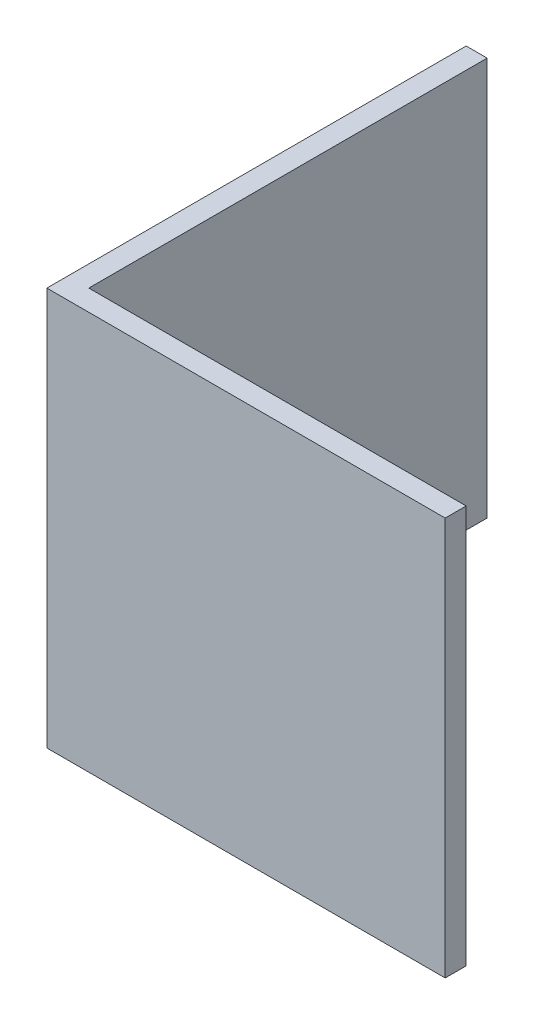
ISO-10303-21;
HEADER;
FILE_DESCRIPTION(('STEP AP214'),'2;1');
FILE_NAME('part.step','',(''),(''),'','','');
FILE_SCHEMA(('AUTOMOTIVE_DESIGN { 1 0 10303 214 1 1 1 1 }'));
ENDSEC;
DATA;
#1=APPLICATION_CONTEXT('core data for automotive mechanical design processes');
#2=APPLICATION_PROTOCOL_DEFINITION('international standard','automotive_design',2000,#1);
#3=PRODUCT_CONTEXT('',#1,'mechanical');
#4=PRODUCT('Part','Part','',(#3));
#5=PRODUCT_RELATED_PRODUCT_CATEGORY('part','',(#4));
#6=PRODUCT_DEFINITION_FORMATION('','',#4);
#7=PRODUCT_DEFINITION_CONTEXT('part definition',#1,'design');
#8=PRODUCT_DEFINITION('design','',#6,#7);
#9=PRODUCT_DEFINITION_SHAPE('','',#8);
#10=(LENGTH_UNIT() NAMED_UNIT(*) SI_UNIT(.MILLI.,.METRE.));
#11=(NAMED_UNIT(*) PLANE_ANGLE_UNIT() SI_UNIT($,.RADIAN.));
#12=(NAMED_UNIT(*) SI_UNIT($,.STERADIAN.) SOLID_ANGLE_UNIT());
#13=UNCERTAINTY_MEASURE_WITH_UNIT(LENGTH_MEASURE(1.E-05),#10,'distance_accuracy_value','');
#14=(GEOMETRIC_REPRESENTATION_CONTEXT(3) GLOBAL_UNCERTAINTY_ASSIGNED_CONTEXT((#13)) GLOBAL_UNIT_ASSIGNED_CONTEXT((#10,
#11,#12)) REPRESENTATION_CONTEXT('',''));
#15=CARTESIAN_POINT('',(0.,0.,0.));
#16=DIRECTION('',(0.,0.,1.));
#17=DIRECTION('',(1.,0.,0.));
#18=AXIS2_PLACEMENT_3D('',#15,#16,#17);
#19=CARTESIAN_POINT('',(20.,19.,0.));
#20=DIRECTION('',(0.,0.,-1.));
#21=DIRECTION('',(-1.,0.,0.));
#22=AXIS2_PLACEMENT_3D('',#19,#20,#21);
#23=PLANE('',#22);
#24=DIRECTION('',(0.,-1.,0.));
#25=VECTOR('',#24,1.);
#26=CARTESIAN_POINT('',(19.,19.,0.));
#27=LINE('',#26,#25);
#28=CARTESIAN_POINT('',(19.,19.,0.));
#29=VERTEX_POINT('',#28);
#30=CARTESIAN_POINT('',(19.,0.,0.));
#31=VERTEX_POINT('',#30);
#32=EDGE_CURVE('E50',#29,#31,#27,.T.);
#33=ORIENTED_EDGE('',*,*,#32,.F.);
#34=DIRECTION('',(1.,0.,0.));
#35=VECTOR('',#34,1.);
#36=CARTESIAN_POINT('',(20.,19.,0.));
#37=LINE('',#36,#35);
#38=CARTESIAN_POINT('',(0.,19.,0.));
#39=VERTEX_POINT('',#38);
#40=EDGE_CURVE('E122',#39,#29,#37,.T.);
#41=ORIENTED_EDGE('',*,*,#40,.F.);
#42=DIRECTION('',(0.,-1.,0.));
#43=VECTOR('',#42,1.);
#44=CARTESIAN_POINT('',(0.,19.,0.));
#45=LINE('',#44,#43);
#46=CARTESIAN_POINT('',(0.,0.,0.));
#47=VERTEX_POINT('',#46);
#48=EDGE_CURVE('E123',#39,#47,#45,.T.);
#49=ORIENTED_EDGE('',*,*,#48,.T.);
#50=DIRECTION('',(1.,0.,0.));
#51=VECTOR('',#50,1.);
#52=CARTESIAN_POINT('',(20.,0.,0.));
#53=LINE('',#52,#51);
#54=EDGE_CURVE('E113',#47,#31,#53,.T.);
#55=ORIENTED_EDGE('',*,*,#54,.T.);
#56=EDGE_LOOP('',(#33,#41,#49,#55));
#57=FACE_BOUND('',#56,.T.);
#58=ADVANCED_FACE('F36',(#57),#23,.F.);
#59=CARTESIAN_POINT('',(1.,19.,-0.999999999999997));
#60=DIRECTION('',(0.,0.,1.));
#61=DIRECTION('',(1.,0.,0.));
#62=AXIS2_PLACEMENT_3D('',#59,#60,#61);
#63=PLANE('',#62);
#64=DIRECTION('',(0.,1.,0.));
#65=VECTOR('',#64,1.);
#66=CARTESIAN_POINT('',(19.,0.,-0.999999999999998));
#67=LINE('',#66,#65);
#68=CARTESIAN_POINT('',(19.,0.,-0.999999999999998));
#69=VERTEX_POINT('',#68);
#70=CARTESIAN_POINT('',(19.,19.,-0.999999999999998));
#71=VERTEX_POINT('',#70);
#72=EDGE_CURVE('E98',#69,#71,#67,.T.);
#73=ORIENTED_EDGE('',*,*,#72,.F.);
#74=DIRECTION('',(-1.,0.,0.));
#75=VECTOR('',#74,1.);
#76=CARTESIAN_POINT('',(1.,0.,-0.999999999999997));
#77=LINE('',#76,#75);
#78=CARTESIAN_POINT('',(1.,0.,-0.999999999999997));
#79=VERTEX_POINT('',#78);
#80=EDGE_CURVE('E106',#69,#79,#77,.T.);
#81=ORIENTED_EDGE('',*,*,#80,.T.);
#82=DIRECTION('',(0.,-1.,0.));
#83=VECTOR('',#82,1.);
#84=CARTESIAN_POINT('',(1.,19.,-0.999999999999997));
#85=LINE('',#84,#83);
#86=CARTESIAN_POINT('',(1.,19.,-0.999999999999997));
#87=VERTEX_POINT('',#86);
#88=EDGE_CURVE('E11',#87,#79,#85,.T.);
#89=ORIENTED_EDGE('',*,*,#88,.F.);
#90=DIRECTION('',(-1.,0.,0.));
#91=VECTOR('',#90,1.);
#92=CARTESIAN_POINT('',(1.,19.,-0.999999999999997));
#93=LINE('',#92,#91);
#94=EDGE_CURVE('E87',#71,#87,#93,.T.);
#95=ORIENTED_EDGE('',*,*,#94,.F.);
#96=EDGE_LOOP('',(#73,#81,#89,#95));
#97=FACE_BOUND('',#96,.T.);
#98=ADVANCED_FACE('F105',(#97),#63,.F.);
#99=CARTESIAN_POINT('',(0.,19.,0.));
#100=DIRECTION('',(0.,-1.,0.));
#101=DIRECTION('',(0.,0.,-1.));
#102=AXIS2_PLACEMENT_3D('',#99,#100,#101);
#103=PLANE('',#102);
#104=DIRECTION('',(0.,0.,1.));
#105=VECTOR('',#104,1.);
#106=CARTESIAN_POINT('',(19.,19.,-0.999999999999998));
#107=LINE('',#106,#105);
#108=EDGE_CURVE('E107',#71,#29,#107,.T.);
#109=ORIENTED_EDGE('',*,*,#108,.F.);
#110=ORIENTED_EDGE('',*,*,#94,.T.);
#111=DIRECTION('',(0.,0.,-1.));
#112=VECTOR('',#111,1.);
#113=CARTESIAN_POINT('',(0.999999999999998,19.,-20.));
#114=LINE('',#113,#112);
#115=CARTESIAN_POINT('',(0.999999999999998,19.,-20.));
#116=VERTEX_POINT('',#115);
#117=EDGE_CURVE('E138',#87,#116,#114,.T.);
#118=ORIENTED_EDGE('',*,*,#117,.T.);
#119=DIRECTION('',(-1.,0.,0.));
#120=VECTOR('',#119,1.);
#121=CARTESIAN_POINT('',(0.,19.,-20.));
#122=LINE('',#121,#120);
#123=CARTESIAN_POINT('',(0.,19.,-20.));
#124=VERTEX_POINT('',#123);
#125=EDGE_CURVE('E132',#116,#124,#122,.T.);
#126=ORIENTED_EDGE('',*,*,#125,.T.);
#127=DIRECTION('',(0.,0.,1.));
#128=VECTOR('',#127,1.);
#129=CARTESIAN_POINT('',(0.,19.,0.));
#130=LINE('',#129,#128);
#131=EDGE_CURVE('E59',#124,#39,#130,.T.);
#132=ORIENTED_EDGE('',*,*,#131,.T.);
#133=ORIENTED_EDGE('',*,*,#40,.T.);
#134=EDGE_LOOP('',(#109,#110,#118,#126,#132,#133));
#135=FACE_BOUND('',#134,.T.);
#136=ADVANCED_FACE('F145',(#135),#103,.F.);
#137=CARTESIAN_POINT('',(0.,0.,0.));
#138=DIRECTION('',(0.,-1.,0.));
#139=DIRECTION('',(0.,0.,-1.));
#140=AXIS2_PLACEMENT_3D('',#137,#138,#139);
#141=PLANE('',#140);
#142=ORIENTED_EDGE('',*,*,#80,.F.);
#143=DIRECTION('',(0.,0.,-1.));
#144=VECTOR('',#143,1.);
#145=CARTESIAN_POINT('',(19.,0.,0.));
#146=LINE('',#145,#144);
#147=EDGE_CURVE('E95',#31,#69,#146,.T.);
#148=ORIENTED_EDGE('',*,*,#147,.F.);
#149=ORIENTED_EDGE('',*,*,#54,.F.);
#150=DIRECTION('',(0.,0.,1.));
#151=VECTOR('',#150,1.);
#152=CARTESIAN_POINT('',(0.,0.,0.));
#153=LINE('',#152,#151);
#154=CARTESIAN_POINT('',(0.,0.,-20.));
#155=VERTEX_POINT('',#154);
#156=EDGE_CURVE('E80',#155,#47,#153,.T.);
#157=ORIENTED_EDGE('',*,*,#156,.F.);
#158=DIRECTION('',(-1.,0.,0.));
#159=VECTOR('',#158,1.);
#160=CARTESIAN_POINT('',(0.,0.,-20.));
#161=LINE('',#160,#159);
#162=CARTESIAN_POINT('',(0.999999999999998,0.,-20.));
#163=VERTEX_POINT('',#162);
#164=EDGE_CURVE('E115',#163,#155,#161,.T.);
#165=ORIENTED_EDGE('',*,*,#164,.F.);
#166=DIRECTION('',(0.,0.,-1.));
#167=VECTOR('',#166,1.);
#168=CARTESIAN_POINT('',(0.999999999999998,0.,-20.));
#169=LINE('',#168,#167);
#170=EDGE_CURVE('E112',#79,#163,#169,.T.);
#171=ORIENTED_EDGE('',*,*,#170,.F.);
#172=EDGE_LOOP('',(#142,#148,#149,#157,#165,#171));
#173=FACE_BOUND('',#172,.T.);
#174=ADVANCED_FACE('F110',(#173),#141,.T.);
#175=CARTESIAN_POINT('',(0.999999999999998,19.,-20.));
#176=DIRECTION('',(-1.,0.,0.));
#177=DIRECTION('',(0.,0.,1.));
#178=AXIS2_PLACEMENT_3D('',#175,#176,#177);
#179=PLANE('',#178);
#180=ORIENTED_EDGE('',*,*,#170,.T.);
#181=DIRECTION('',(0.,-1.,0.));
#182=VECTOR('',#181,1.);
#183=CARTESIAN_POINT('',(0.999999999999998,19.,-20.));
#184=LINE('',#183,#182);
#185=EDGE_CURVE('E43',#116,#163,#184,.T.);
#186=ORIENTED_EDGE('',*,*,#185,.F.);
#187=ORIENTED_EDGE('',*,*,#117,.F.);
#188=ORIENTED_EDGE('',*,*,#88,.T.);
#189=EDGE_LOOP('',(#180,#186,#187,#188));
#190=FACE_BOUND('',#189,.T.);
#191=ADVANCED_FACE('F152',(#190),#179,.F.);
#192=CARTESIAN_POINT('',(0.,19.,-20.));
#193=DIRECTION('',(0.,0.,1.));
#194=DIRECTION('',(1.,0.,0.));
#195=AXIS2_PLACEMENT_3D('',#192,#193,#194);
#196=PLANE('',#195);
#197=ORIENTED_EDGE('',*,*,#164,.T.);
#198=DIRECTION('',(0.,-1.,0.));
#199=VECTOR('',#198,1.);
#200=CARTESIAN_POINT('',(0.,19.,-20.));
#201=LINE('',#200,#199);
#202=EDGE_CURVE('E125',#124,#155,#201,.T.);
#203=ORIENTED_EDGE('',*,*,#202,.F.);
#204=ORIENTED_EDGE('',*,*,#125,.F.);
#205=ORIENTED_EDGE('',*,*,#185,.T.);
#206=EDGE_LOOP('',(#197,#203,#204,#205));
#207=FACE_BOUND('',#206,.T.);
#208=ADVANCED_FACE('F130',(#207),#196,.F.);
#209=CARTESIAN_POINT('',(0.,19.,0.));
#210=DIRECTION('',(1.,0.,0.));
#211=DIRECTION('',(0.,0.,-1.));
#212=AXIS2_PLACEMENT_3D('',#209,#210,#211);
#213=PLANE('',#212);
#214=ORIENTED_EDGE('',*,*,#156,.T.);
#215=ORIENTED_EDGE('',*,*,#48,.F.);
#216=ORIENTED_EDGE('',*,*,#131,.F.);
#217=ORIENTED_EDGE('',*,*,#202,.T.);
#218=EDGE_LOOP('',(#214,#215,#216,#217));
#219=FACE_BOUND('',#218,.T.);
#220=ADVANCED_FACE('F137',(#219),#213,.F.);
#221=CARTESIAN_POINT('',(19.,0.,0.));
#222=DIRECTION('',(1.,0.,0.));
#223=DIRECTION('',(0.,0.,-1.));
#224=AXIS2_PLACEMENT_3D('',#221,#222,#223);
#225=PLANE('',#224);
#226=ORIENTED_EDGE('',*,*,#32,.T.);
#227=ORIENTED_EDGE('',*,*,#147,.T.);
#228=ORIENTED_EDGE('',*,*,#72,.T.);
#229=ORIENTED_EDGE('',*,*,#108,.T.);
#230=EDGE_LOOP('',(#226,#227,#228,#229));
#231=FACE_BOUND('',#230,.T.);
#232=ADVANCED_FACE('F97',(#231),#225,.T.);
#233=CLOSED_SHELL('',(#58,#98,#136,#174,#191,#208,#220,#232));
#234=MANIFOLD_SOLID_BREP('B2',#233);
#235=ADVANCED_BREP_SHAPE_REPRESENTATION('',(#18,#234),#14);
#236=SHAPE_DEFINITION_REPRESENTATION(#9,#235);
ENDSEC;
END-ISO-10303-21;
